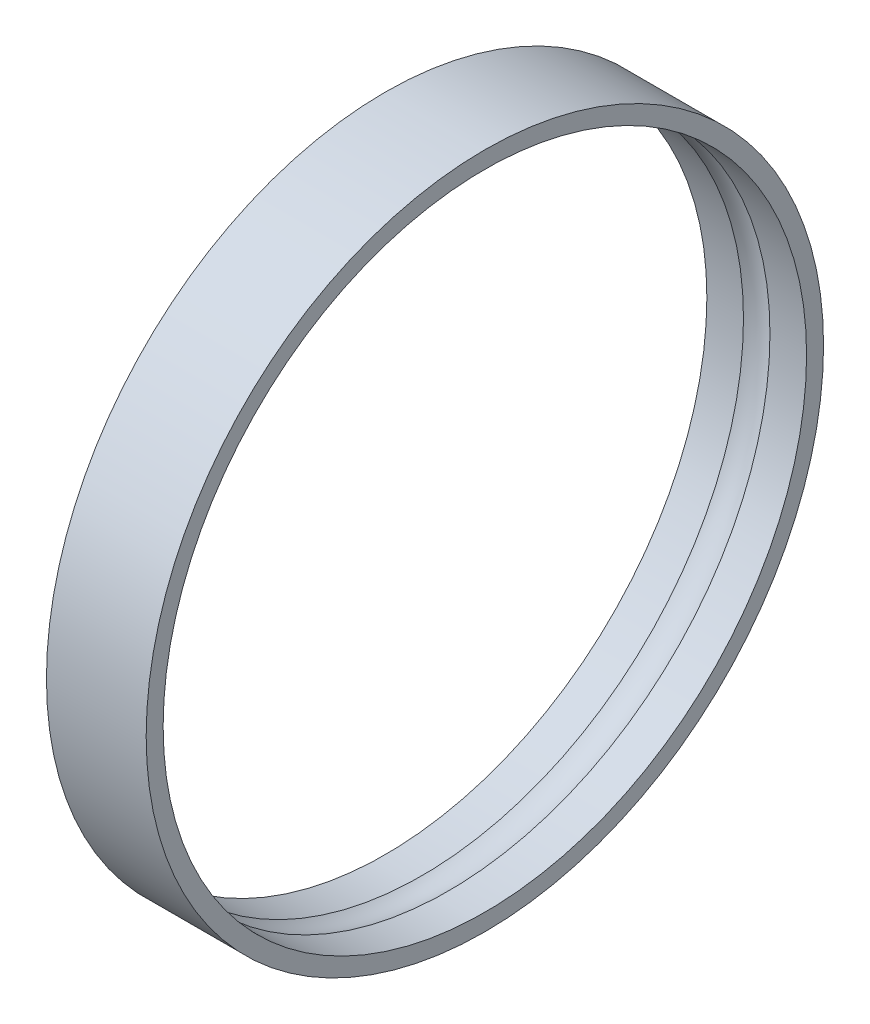
ISO-10303-21;
HEADER;
FILE_DESCRIPTION(('STEP AP214'),'2;1');
FILE_NAME('part.step','',(''),(''),'','','');
FILE_SCHEMA(('AUTOMOTIVE_DESIGN { 1 0 10303 214 1 1 1 1 }'));
ENDSEC;
DATA;
#1=APPLICATION_CONTEXT('core data for automotive mechanical design processes');
#2=APPLICATION_PROTOCOL_DEFINITION('international standard','automotive_design',2000,#1);
#3=PRODUCT_CONTEXT('',#1,'mechanical');
#4=PRODUCT('Part','Part','',(#3));
#5=PRODUCT_RELATED_PRODUCT_CATEGORY('part','',(#4));
#6=PRODUCT_DEFINITION_FORMATION('','',#4);
#7=PRODUCT_DEFINITION_CONTEXT('part definition',#1,'design');
#8=PRODUCT_DEFINITION('design','',#6,#7);
#9=PRODUCT_DEFINITION_SHAPE('','',#8);
#10=(LENGTH_UNIT() NAMED_UNIT(*) SI_UNIT(.MILLI.,.METRE.));
#11=(NAMED_UNIT(*) PLANE_ANGLE_UNIT() SI_UNIT($,.RADIAN.));
#12=(NAMED_UNIT(*) SI_UNIT($,.STERADIAN.) SOLID_ANGLE_UNIT());
#13=UNCERTAINTY_MEASURE_WITH_UNIT(LENGTH_MEASURE(1.E-05),#10,'distance_accuracy_value','');
#14=(GEOMETRIC_REPRESENTATION_CONTEXT(3) GLOBAL_UNCERTAINTY_ASSIGNED_CONTEXT((#13)) GLOBAL_UNIT_ASSIGNED_CONTEXT((#10,
#11,#12)) REPRESENTATION_CONTEXT('',''));
#15=CARTESIAN_POINT('',(0.,0.,0.));
#16=DIRECTION('',(0.,0.,1.));
#17=DIRECTION('',(1.,0.,0.));
#18=AXIS2_PLACEMENT_3D('',#15,#16,#17);
#19=CARTESIAN_POINT('',(64.16,0.,0.));
#20=DIRECTION('',(1.,0.,0.));
#21=DIRECTION('',(0.,0.,-1.));
#22=AXIS2_PLACEMENT_3D('',#19,#20,#21);
#23=TOROIDAL_SURFACE('',#22,69.383,7.15);
#24=CARTESIAN_POINT('',(61.0392611451773,0.,0.));
#25=DIRECTION('',(-1.,0.,0.));
#26=DIRECTION('',(0.,0.,1.));
#27=AXIS2_PLACEMENT_3D('',#24,#25,#26);
#28=CIRCLE('',#27,75.816);
#29=CARTESIAN_POINT('',(61.0392611451773,0.,75.816));
#30=VERTEX_POINT('',#29);
#31=EDGE_CURVE('E30',#30,#30,#28,.T.);
#32=ORIENTED_EDGE('',*,*,#31,.T.);
#33=EDGE_LOOP('',(#32));
#34=FACE_BOUND('',#33,.T.);
#35=CARTESIAN_POINT('',(67.2807388548227,0.,0.));
#36=DIRECTION('',(-1.,0.,0.));
#37=DIRECTION('',(0.,0.,1.));
#38=AXIS2_PLACEMENT_3D('',#35,#36,#37);
#39=CIRCLE('',#38,75.816);
#40=CARTESIAN_POINT('',(67.2807388548227,0.,75.816));
#41=VERTEX_POINT('',#40);
#42=EDGE_CURVE('E35',#41,#41,#39,.F.);
#43=ORIENTED_EDGE('',*,*,#42,.T.);
#44=EDGE_LOOP('',(#43));
#45=FACE_BOUND('',#44,.T.);
#46=ADVANCED_FACE('F14',(#34,#45),#23,.F.);
#47=CARTESIAN_POINT('',(64.16,0.,0.));
#48=DIRECTION('',(-1.,0.,0.));
#49=DIRECTION('',(0.,0.,1.));
#50=AXIS2_PLACEMENT_3D('',#47,#48,#49);
#51=CYLINDRICAL_SURFACE('',#50,75.816);
#52=CARTESIAN_POINT('',(52.41,0.,0.));
#53=DIRECTION('',(-1.,0.,0.));
#54=DIRECTION('',(0.,0.,1.));
#55=AXIS2_PLACEMENT_3D('',#52,#53,#54);
#56=CIRCLE('',#55,75.816);
#57=CARTESIAN_POINT('',(52.41,0.,75.816));
#58=VERTEX_POINT('',#57);
#59=EDGE_CURVE('E18',#58,#58,#56,.F.);
#60=ORIENTED_EDGE('',*,*,#59,.F.);
#61=EDGE_LOOP('',(#60));
#62=FACE_BOUND('',#61,.T.);
#63=ORIENTED_EDGE('',*,*,#31,.F.);
#64=EDGE_LOOP('',(#63));
#65=FACE_BOUND('',#64,.T.);
#66=ADVANCED_FACE('F47',(#62,#65),#51,.F.);
#67=CARTESIAN_POINT('',(64.16,0.,0.));
#68=DIRECTION('',(-1.,0.,0.));
#69=DIRECTION('',(0.,0.,1.));
#70=AXIS2_PLACEMENT_3D('',#67,#68,#69);
#71=CYLINDRICAL_SURFACE('',#70,75.816);
#72=ORIENTED_EDGE('',*,*,#42,.F.);
#73=EDGE_LOOP('',(#72));
#74=FACE_BOUND('',#73,.T.);
#75=CARTESIAN_POINT('',(75.91,0.,0.));
#76=DIRECTION('',(-1.,0.,0.));
#77=DIRECTION('',(0.,0.,1.));
#78=AXIS2_PLACEMENT_3D('',#75,#76,#77);
#79=CIRCLE('',#78,75.816);
#80=CARTESIAN_POINT('',(75.91,0.,75.816));
#81=VERTEX_POINT('',#80);
#82=EDGE_CURVE('E27',#81,#81,#79,.T.);
#83=ORIENTED_EDGE('',*,*,#82,.F.);
#84=EDGE_LOOP('',(#83));
#85=FACE_BOUND('',#84,.T.);
#86=ADVANCED_FACE('F49',(#74,#85),#71,.F.);
#87=CARTESIAN_POINT('',(52.41,0.,77.816));
#88=DIRECTION('',(-1.,0.,0.));
#89=DIRECTION('',(0.,0.,1.));
#90=AXIS2_PLACEMENT_3D('',#87,#88,#89);
#91=PLANE('',#90);
#92=ORIENTED_EDGE('',*,*,#59,.T.);
#93=EDGE_LOOP('',(#92));
#94=FACE_BOUND('',#93,.T.);
#95=CARTESIAN_POINT('',(52.41,0.,0.));
#96=DIRECTION('',(-1.,0.,0.));
#97=DIRECTION('',(0.,0.,1.));
#98=AXIS2_PLACEMENT_3D('',#95,#96,#97);
#99=CIRCLE('',#98,79.816);
#100=CARTESIAN_POINT('',(52.41,0.,79.816));
#101=VERTEX_POINT('',#100);
#102=EDGE_CURVE('E22',#101,#101,#99,.F.);
#103=ORIENTED_EDGE('',*,*,#102,.F.);
#104=EDGE_LOOP('',(#103));
#105=FACE_BOUND('',#104,.T.);
#106=ADVANCED_FACE('F56',(#94,#105),#91,.T.);
#107=CARTESIAN_POINT('',(75.91,0.,77.816));
#108=DIRECTION('',(1.,0.,0.));
#109=DIRECTION('',(0.,0.,-1.));
#110=AXIS2_PLACEMENT_3D('',#107,#108,#109);
#111=PLANE('',#110);
#112=CARTESIAN_POINT('',(75.91,0.,0.));
#113=DIRECTION('',(-1.,0.,0.));
#114=DIRECTION('',(0.,0.,1.));
#115=AXIS2_PLACEMENT_3D('',#112,#113,#114);
#116=CIRCLE('',#115,79.816);
#117=CARTESIAN_POINT('',(75.91,0.,79.816));
#118=VERTEX_POINT('',#117);
#119=EDGE_CURVE('E10',#118,#118,#116,.T.);
#120=ORIENTED_EDGE('',*,*,#119,.F.);
#121=EDGE_LOOP('',(#120));
#122=FACE_BOUND('',#121,.T.);
#123=ORIENTED_EDGE('',*,*,#82,.T.);
#124=EDGE_LOOP('',(#123));
#125=FACE_BOUND('',#124,.T.);
#126=ADVANCED_FACE('F61',(#122,#125),#111,.T.);
#127=CARTESIAN_POINT('',(64.16,0.,0.));
#128=DIRECTION('',(-1.,0.,0.));
#129=DIRECTION('',(0.,0.,1.));
#130=AXIS2_PLACEMENT_3D('',#127,#128,#129);
#131=CYLINDRICAL_SURFACE('',#130,79.816);
#132=ORIENTED_EDGE('',*,*,#102,.T.);
#133=EDGE_LOOP('',(#132));
#134=FACE_BOUND('',#133,.T.);
#135=ORIENTED_EDGE('',*,*,#119,.T.);
#136=EDGE_LOOP('',(#135));
#137=FACE_BOUND('',#136,.T.);
#138=ADVANCED_FACE('F59',(#134,#137),#131,.T.);
#139=CLOSED_SHELL('',(#46,#66,#86,#106,#126,#138));
#140=MANIFOLD_SOLID_BREP('B1',#139);
#141=ADVANCED_BREP_SHAPE_REPRESENTATION('',(#18,#140),#14);
#142=SHAPE_DEFINITION_REPRESENTATION(#9,#141);
ENDSEC;
END-ISO-10303-21;
